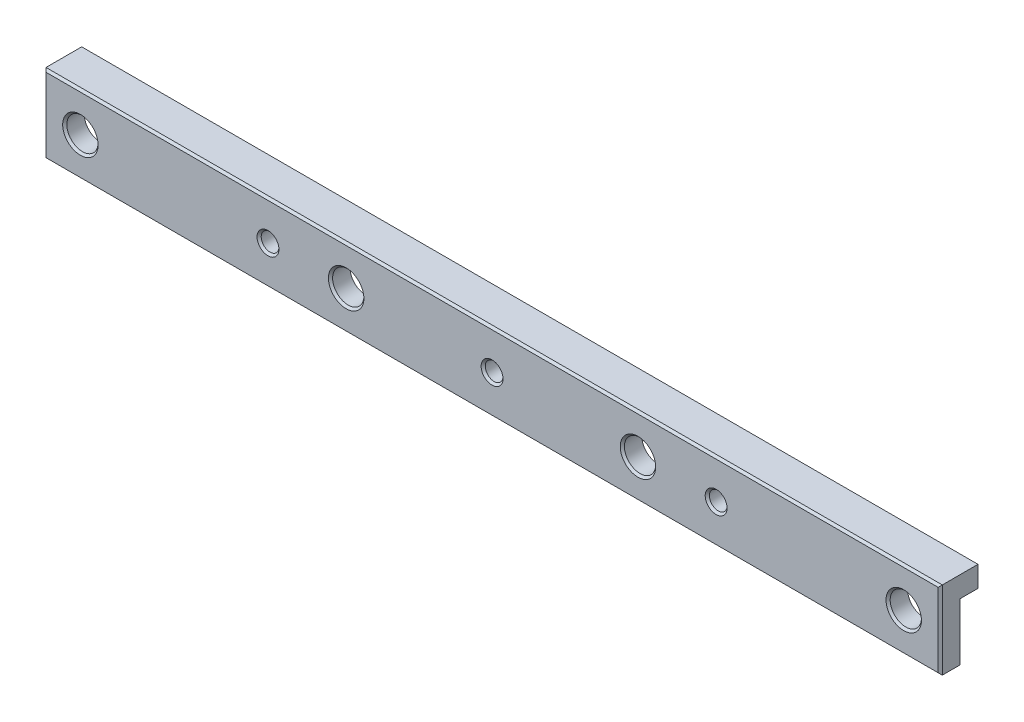
ISO-10303-21;
HEADER;
FILE_DESCRIPTION(('STEP AP214'),'2;1');
FILE_NAME('part.step','',(''),(''),'','','');
FILE_SCHEMA(('AUTOMOTIVE_DESIGN { 1 0 10303 214 1 1 1 1 }'));
ENDSEC;
DATA;
#1=APPLICATION_CONTEXT('core data for automotive mechanical design processes');
#2=APPLICATION_PROTOCOL_DEFINITION('international standard','automotive_design',2000,#1);
#3=PRODUCT_CONTEXT('',#1,'mechanical');
#4=PRODUCT('Part','Part','',(#3));
#5=PRODUCT_RELATED_PRODUCT_CATEGORY('part','',(#4));
#6=PRODUCT_DEFINITION_FORMATION('','',#4);
#7=PRODUCT_DEFINITION_CONTEXT('part definition',#1,'design');
#8=PRODUCT_DEFINITION('design','',#6,#7);
#9=PRODUCT_DEFINITION_SHAPE('','',#8);
#10=(LENGTH_UNIT() NAMED_UNIT(*) SI_UNIT(.MILLI.,.METRE.));
#11=(NAMED_UNIT(*) PLANE_ANGLE_UNIT() SI_UNIT($,.RADIAN.));
#12=(NAMED_UNIT(*) SI_UNIT($,.STERADIAN.) SOLID_ANGLE_UNIT());
#13=UNCERTAINTY_MEASURE_WITH_UNIT(LENGTH_MEASURE(1.E-05),#10,'distance_accuracy_value','');
#14=(GEOMETRIC_REPRESENTATION_CONTEXT(3) GLOBAL_UNCERTAINTY_ASSIGNED_CONTEXT((#13)) GLOBAL_UNIT_ASSIGNED_CONTEXT((#10,
#11,#12)) REPRESENTATION_CONTEXT('',''));
#15=CARTESIAN_POINT('',(0.,0.,0.));
#16=DIRECTION('',(0.,0.,1.));
#17=DIRECTION('',(1.,0.,0.));
#18=AXIS2_PLACEMENT_3D('',#15,#16,#17);
#19=CARTESIAN_POINT('',(86.,0.,-7.25));
#20=DIRECTION('',(-1.,0.,0.));
#21=DIRECTION('',(0.,0.,1.));
#22=AXIS2_PLACEMENT_3D('',#19,#20,#21);
#23=PLANE('',#22);
#24=DIRECTION('',(0.,0.,1.));
#25=VECTOR('',#24,1.);
#26=CARTESIAN_POINT('',(86.,7.50000000000001,-7.25));
#27=LINE('',#26,#25);
#28=CARTESIAN_POINT('',(86.,7.50000000000001,-7.25));
#29=VERTEX_POINT('',#28);
#30=CARTESIAN_POINT('',(86.,7.50000000000001,-0.400000000000013));
#31=VERTEX_POINT('',#30);
#32=EDGE_CURVE('E136',#29,#31,#27,.T.);
#33=ORIENTED_EDGE('',*,*,#32,.T.);
#34=DIRECTION('',(0.,-1.,0.));
#35=VECTOR('',#34,1.);
#36=CARTESIAN_POINT('',(86.,-7.49999999999999,-0.400000000000011));
#37=LINE('',#36,#35);
#38=CARTESIAN_POINT('',(86.,-7.49999999999999,-0.400000000000013));
#39=VERTEX_POINT('',#38);
#40=EDGE_CURVE('E196',#31,#39,#37,.T.);
#41=ORIENTED_EDGE('',*,*,#40,.T.);
#42=DIRECTION('',(0.,0.,1.));
#43=VECTOR('',#42,1.);
#44=CARTESIAN_POINT('',(86.,-7.49999999999999,-7.25));
#45=LINE('',#44,#43);
#46=CARTESIAN_POINT('',(86.,-7.49999999999999,-3.75));
#47=VERTEX_POINT('',#46);
#48=EDGE_CURVE('E132',#47,#39,#45,.T.);
#49=ORIENTED_EDGE('',*,*,#48,.F.);
#50=DIRECTION('',(0.,-1.,0.));
#51=VECTOR('',#50,1.);
#52=CARTESIAN_POINT('',(86.,0.,-3.75));
#53=LINE('',#52,#51);
#54=CARTESIAN_POINT('',(86.,3.50000000000001,-3.75));
#55=VERTEX_POINT('',#54);
#56=EDGE_CURVE('E115',#55,#47,#53,.T.);
#57=ORIENTED_EDGE('',*,*,#56,.F.);
#58=DIRECTION('',(0.,0.,-1.));
#59=VECTOR('',#58,1.);
#60=CARTESIAN_POINT('',(86.,3.50000000000001,-3.75));
#61=LINE('',#60,#59);
#62=CARTESIAN_POINT('',(86.,3.50000000000001,-7.25));
#63=VERTEX_POINT('',#62);
#64=EDGE_CURVE('E371',#55,#63,#61,.T.);
#65=ORIENTED_EDGE('',*,*,#64,.T.);
#66=DIRECTION('',(0.,-1.,0.));
#67=VECTOR('',#66,1.);
#68=CARTESIAN_POINT('',(86.,0.,-7.25));
#69=LINE('',#68,#67);
#70=EDGE_CURVE('E367',#29,#63,#69,.T.);
#71=ORIENTED_EDGE('',*,*,#70,.F.);
#72=EDGE_LOOP('',(#33,#41,#49,#57,#65,#71));
#73=FACE_BOUND('',#72,.T.);
#74=ADVANCED_FACE('F39',(#73),#23,.F.);
#75=CARTESIAN_POINT('',(-86.,0.,-7.25));
#76=DIRECTION('',(-1.,0.,0.));
#77=DIRECTION('',(0.,0.,1.));
#78=AXIS2_PLACEMENT_3D('',#75,#76,#77);
#79=PLANE('',#78);
#80=DIRECTION('',(0.,0.,1.));
#81=VECTOR('',#80,1.);
#82=CARTESIAN_POINT('',(-86.,-7.50000000000001,-7.25));
#83=LINE('',#82,#81);
#84=CARTESIAN_POINT('',(-86.,-7.50000000000001,-3.75));
#85=VERTEX_POINT('',#84);
#86=CARTESIAN_POINT('',(-86.,-7.50000000000001,-0.400000000000013));
#87=VERTEX_POINT('',#86);
#88=EDGE_CURVE('E123',#85,#87,#83,.T.);
#89=ORIENTED_EDGE('',*,*,#88,.T.);
#90=DIRECTION('',(0.,1.,0.));
#91=VECTOR('',#90,1.);
#92=CARTESIAN_POINT('',(-86.,0.,-0.400000000000011));
#93=LINE('',#92,#91);
#94=CARTESIAN_POINT('',(-86.,7.49999999999999,-0.400000000000013));
#95=VERTEX_POINT('',#94);
#96=EDGE_CURVE('E65',#87,#95,#93,.T.);
#97=ORIENTED_EDGE('',*,*,#96,.T.);
#98=DIRECTION('',(0.,0.,1.));
#99=VECTOR('',#98,1.);
#100=CARTESIAN_POINT('',(-86.,7.49999999999999,-7.25));
#101=LINE('',#100,#99);
#102=CARTESIAN_POINT('',(-86.,7.49999999999999,-7.25));
#103=VERTEX_POINT('',#102);
#104=EDGE_CURVE('E133',#103,#95,#101,.T.);
#105=ORIENTED_EDGE('',*,*,#104,.F.);
#106=DIRECTION('',(0.,-1.,0.));
#107=VECTOR('',#106,1.);
#108=CARTESIAN_POINT('',(-86.,0.,-7.25));
#109=LINE('',#108,#107);
#110=CARTESIAN_POINT('',(-86.,3.49999999999999,-7.25));
#111=VERTEX_POINT('',#110);
#112=EDGE_CURVE('E141',#103,#111,#109,.T.);
#113=ORIENTED_EDGE('',*,*,#112,.T.);
#114=DIRECTION('',(0.,0.,-1.));
#115=VECTOR('',#114,1.);
#116=CARTESIAN_POINT('',(-86.,3.49999999999999,-3.75));
#117=LINE('',#116,#115);
#118=CARTESIAN_POINT('',(-86.,3.49999999999999,-3.75));
#119=VERTEX_POINT('',#118);
#120=EDGE_CURVE('E125',#119,#111,#117,.T.);
#121=ORIENTED_EDGE('',*,*,#120,.F.);
#122=DIRECTION('',(0.,-1.,0.));
#123=VECTOR('',#122,1.);
#124=CARTESIAN_POINT('',(-86.,0.,-3.75));
#125=LINE('',#124,#123);
#126=EDGE_CURVE('E112',#119,#85,#125,.T.);
#127=ORIENTED_EDGE('',*,*,#126,.T.);
#128=EDGE_LOOP('',(#89,#97,#105,#113,#121,#127));
#129=FACE_BOUND('',#128,.T.);
#130=ADVANCED_FACE('F122',(#129),#79,.T.);
#131=CARTESIAN_POINT('',(0.,0.,-7.25));
#132=DIRECTION('',(0.,0.,1.));
#133=DIRECTION('',(1.,0.,0.));
#134=AXIS2_PLACEMENT_3D('',#131,#132,#133);
#135=PLANE('',#134);
#136=DIRECTION('',(-1.,0.,0.));
#137=VECTOR('',#136,1.);
#138=CARTESIAN_POINT('',(0.,3.5,-7.25));
#139=LINE('',#138,#137);
#140=EDGE_CURVE('E120',#63,#111,#139,.T.);
#141=ORIENTED_EDGE('',*,*,#140,.T.);
#142=ORIENTED_EDGE('',*,*,#112,.F.);
#143=DIRECTION('',(-1.,0.,0.));
#144=VECTOR('',#143,1.);
#145=CARTESIAN_POINT('',(0.,7.5,-7.25));
#146=LINE('',#145,#144);
#147=EDGE_CURVE('E363',#29,#103,#146,.T.);
#148=ORIENTED_EDGE('',*,*,#147,.F.);
#149=ORIENTED_EDGE('',*,*,#70,.T.);
#150=EDGE_LOOP('',(#141,#142,#148,#149));
#151=FACE_BOUND('',#150,.T.);
#152=ADVANCED_FACE('F257',(#151),#135,.F.);
#153=CARTESIAN_POINT('',(0.,-7.5,-7.25));
#154=DIRECTION('',(0.,1.,0.));
#155=DIRECTION('',(-1.,0.,0.));
#156=AXIS2_PLACEMENT_3D('',#153,#154,#155);
#157=PLANE('',#156);
#158=ORIENTED_EDGE('',*,*,#48,.T.);
#159=DIRECTION('',(-1.,0.,0.));
#160=VECTOR('',#159,1.);
#161=CARTESIAN_POINT('',(-86.,-7.50000000000001,-0.400000000000011));
#162=LINE('',#161,#160);
#163=EDGE_CURVE('E131',#39,#87,#162,.T.);
#164=ORIENTED_EDGE('',*,*,#163,.T.);
#165=ORIENTED_EDGE('',*,*,#88,.F.);
#166=DIRECTION('',(-1.,0.,0.));
#167=VECTOR('',#166,1.);
#168=CARTESIAN_POINT('',(0.,-7.5,-3.75));
#169=LINE('',#168,#167);
#170=EDGE_CURVE('E108',#47,#85,#169,.T.);
#171=ORIENTED_EDGE('',*,*,#170,.F.);
#172=EDGE_LOOP('',(#158,#164,#165,#171));
#173=FACE_BOUND('',#172,.T.);
#174=ADVANCED_FACE('F129',(#173),#157,.F.);
#175=CARTESIAN_POINT('',(0.,7.5,-7.25));
#176=DIRECTION('',(0.,1.,0.));
#177=DIRECTION('',(-1.,0.,0.));
#178=AXIS2_PLACEMENT_3D('',#175,#176,#177);
#179=PLANE('',#178);
#180=ORIENTED_EDGE('',*,*,#104,.T.);
#181=DIRECTION('',(1.,0.,0.));
#182=VECTOR('',#181,1.);
#183=CARTESIAN_POINT('',(0.,7.5,-0.400000000000011));
#184=LINE('',#183,#182);
#185=EDGE_CURVE('E57',#95,#31,#184,.T.);
#186=ORIENTED_EDGE('',*,*,#185,.T.);
#187=ORIENTED_EDGE('',*,*,#32,.F.);
#188=ORIENTED_EDGE('',*,*,#147,.T.);
#189=EDGE_LOOP('',(#180,#186,#187,#188));
#190=FACE_BOUND('',#189,.T.);
#191=ADVANCED_FACE('F260',(#190),#179,.T.);
#192=CARTESIAN_POINT('',(0.,0.,0.));
#193=DIRECTION('',(0.,0.,1.));
#194=DIRECTION('',(1.,0.,0.));
#195=AXIS2_PLACEMENT_3D('',#192,#193,#194);
#196=PLANE('',#195);
#197=DIRECTION('',(0.,-1.,0.));
#198=VECTOR('',#197,1.);
#199=CARTESIAN_POINT('',(-85.6,0.,0.));
#200=LINE('',#199,#198);
#201=CARTESIAN_POINT('',(-85.6,7.09999999999998,0.));
#202=VERTEX_POINT('',#201);
#203=CARTESIAN_POINT('',(-85.6,-7.1,0.));
#204=VERTEX_POINT('',#203);
#205=EDGE_CURVE('E189',#202,#204,#200,.T.);
#206=ORIENTED_EDGE('',*,*,#205,.T.);
#207=DIRECTION('',(1.,0.,0.));
#208=VECTOR('',#207,1.);
#209=CARTESIAN_POINT('',(86.,-7.09999999999998,0.));
#210=LINE('',#209,#208);
#211=CARTESIAN_POINT('',(85.6,-7.09999999999998,0.));
#212=VERTEX_POINT('',#211);
#213=EDGE_CURVE('E191',#204,#212,#210,.T.);
#214=ORIENTED_EDGE('',*,*,#213,.T.);
#215=DIRECTION('',(0.,1.,0.));
#216=VECTOR('',#215,1.);
#217=CARTESIAN_POINT('',(85.6,7.50000000000001,0.));
#218=LINE('',#217,#216);
#219=CARTESIAN_POINT('',(85.6,7.1,0.));
#220=VERTEX_POINT('',#219);
#221=EDGE_CURVE('E185',#212,#220,#218,.T.);
#222=ORIENTED_EDGE('',*,*,#221,.T.);
#223=DIRECTION('',(-1.,0.,0.));
#224=VECTOR('',#223,1.);
#225=CARTESIAN_POINT('',(0.,7.09999999999999,0.));
#226=LINE('',#225,#224);
#227=EDGE_CURVE('E187',#220,#202,#226,.T.);
#228=ORIENTED_EDGE('',*,*,#227,.T.);
#229=EDGE_LOOP('',(#206,#214,#222,#228));
#230=FACE_BOUND('',#229,.T.);
#231=CARTESIAN_POINT('',(0.,0.,0.));
#232=DIRECTION('',(0.,0.,1.));
#233=DIRECTION('',(1.,0.,0.));
#234=AXIS2_PLACEMENT_3D('',#231,#232,#233);
#235=CIRCLE('',#234,2.1000000000001);
#236=CARTESIAN_POINT('',(2.1000000000001,0.,0.));
#237=VERTEX_POINT('',#236);
#238=EDGE_CURVE('E182',#237,#237,#235,.F.);
#239=ORIENTED_EDGE('',*,*,#238,.T.);
#240=EDGE_LOOP('',(#239));
#241=FACE_BOUND('',#240,.T.);
#242=CARTESIAN_POINT('',(28.,0.,0.));
#243=DIRECTION('',(0.,0.,1.));
#244=DIRECTION('',(1.,0.,0.));
#245=AXIS2_PLACEMENT_3D('',#242,#243,#244);
#246=CIRCLE('',#245,3.4000000000001);
#247=CARTESIAN_POINT('',(31.4000000000001,0.,0.));
#248=VERTEX_POINT('',#247);
#249=EDGE_CURVE('E179',#248,#248,#246,.F.);
#250=ORIENTED_EDGE('',*,*,#249,.T.);
#251=EDGE_LOOP('',(#250));
#252=FACE_BOUND('',#251,.T.);
#253=CARTESIAN_POINT('',(-28.,0.,0.));
#254=DIRECTION('',(0.,0.,1.));
#255=DIRECTION('',(1.,0.,0.));
#256=AXIS2_PLACEMENT_3D('',#253,#254,#255);
#257=CIRCLE('',#256,3.40000000000007);
#258=CARTESIAN_POINT('',(-24.5999999999999,0.,0.));
#259=VERTEX_POINT('',#258);
#260=EDGE_CURVE('E176',#259,#259,#257,.F.);
#261=ORIENTED_EDGE('',*,*,#260,.T.);
#262=EDGE_LOOP('',(#261));
#263=FACE_BOUND('',#262,.T.);
#264=CARTESIAN_POINT('',(-43.,0.,0.));
#265=DIRECTION('',(0.,0.,1.));
#266=DIRECTION('',(1.,0.,0.));
#267=AXIS2_PLACEMENT_3D('',#264,#265,#266);
#268=CIRCLE('',#267,2.1000000000001);
#269=CARTESIAN_POINT('',(-40.8999999999999,0.,0.));
#270=VERTEX_POINT('',#269);
#271=EDGE_CURVE('E173',#270,#270,#268,.F.);
#272=ORIENTED_EDGE('',*,*,#271,.T.);
#273=EDGE_LOOP('',(#272));
#274=FACE_BOUND('',#273,.T.);
#275=CARTESIAN_POINT('',(43.,0.,0.));
#276=DIRECTION('',(0.,0.,1.));
#277=DIRECTION('',(1.,0.,0.));
#278=AXIS2_PLACEMENT_3D('',#275,#276,#277);
#279=CIRCLE('',#278,2.1000000000001);
#280=CARTESIAN_POINT('',(45.1000000000001,0.,0.));
#281=VERTEX_POINT('',#280);
#282=EDGE_CURVE('E170',#281,#281,#279,.F.);
#283=ORIENTED_EDGE('',*,*,#282,.T.);
#284=EDGE_LOOP('',(#283));
#285=FACE_BOUND('',#284,.T.);
#286=CARTESIAN_POINT('',(-79.,0.,0.));
#287=DIRECTION('',(0.,0.,1.));
#288=DIRECTION('',(1.,0.,0.));
#289=AXIS2_PLACEMENT_3D('',#286,#287,#288);
#290=CIRCLE('',#289,3.40000000000007);
#291=CARTESIAN_POINT('',(-75.5999999999999,0.,0.));
#292=VERTEX_POINT('',#291);
#293=EDGE_CURVE('E167',#292,#292,#290,.F.);
#294=ORIENTED_EDGE('',*,*,#293,.T.);
#295=EDGE_LOOP('',(#294));
#296=FACE_BOUND('',#295,.T.);
#297=CARTESIAN_POINT('',(79.,0.,0.));
#298=DIRECTION('',(0.,0.,1.));
#299=DIRECTION('',(1.,0.,0.));
#300=AXIS2_PLACEMENT_3D('',#297,#298,#299);
#301=CIRCLE('',#300,3.4000000000001);
#302=CARTESIAN_POINT('',(82.4000000000001,0.,0.));
#303=VERTEX_POINT('',#302);
#304=EDGE_CURVE('E164',#303,#303,#301,.F.);
#305=ORIENTED_EDGE('',*,*,#304,.T.);
#306=EDGE_LOOP('',(#305));
#307=FACE_BOUND('',#306,.T.);
#308=ADVANCED_FACE('F234',(#230,#241,#252,#263,#274,#285,#296,#307),#196,.T.);
#309=CARTESIAN_POINT('',(0.,3.5,-3.75));
#310=DIRECTION('',(0.,-1.,0.));
#311=DIRECTION('',(1.,0.,0.));
#312=AXIS2_PLACEMENT_3D('',#309,#310,#311);
#313=PLANE('',#312);
#314=ORIENTED_EDGE('',*,*,#140,.F.);
#315=ORIENTED_EDGE('',*,*,#64,.F.);
#316=DIRECTION('',(-1.,0.,0.));
#317=VECTOR('',#316,1.);
#318=CARTESIAN_POINT('',(0.,3.5,-3.75));
#319=LINE('',#318,#317);
#320=EDGE_CURVE('E126',#55,#119,#319,.T.);
#321=ORIENTED_EDGE('',*,*,#320,.T.);
#322=ORIENTED_EDGE('',*,*,#120,.T.);
#323=EDGE_LOOP('',(#314,#315,#321,#322));
#324=FACE_BOUND('',#323,.T.);
#325=ADVANCED_FACE('F321',(#324),#313,.T.);
#326=CARTESIAN_POINT('',(0.,0.,-3.75));
#327=DIRECTION('',(0.,0.,1.));
#328=DIRECTION('',(1.,0.,0.));
#329=AXIS2_PLACEMENT_3D('',#326,#327,#328);
#330=PLANE('',#329);
#331=CARTESIAN_POINT('',(79.,0.,-3.75));
#332=DIRECTION('',(0.,0.,1.));
#333=DIRECTION('',(1.,0.,0.));
#334=AXIS2_PLACEMENT_3D('',#331,#332,#333);
#335=CIRCLE('',#334,3.00000000000001);
#336=CARTESIAN_POINT('',(82.,0.,-3.75));
#337=VERTEX_POINT('',#336);
#338=EDGE_CURVE('E160',#337,#337,#335,.T.);
#339=ORIENTED_EDGE('',*,*,#338,.T.);
#340=EDGE_LOOP('',(#339));
#341=FACE_BOUND('',#340,.T.);
#342=CARTESIAN_POINT('',(-79.,0.,-3.75));
#343=DIRECTION('',(0.,0.,1.));
#344=DIRECTION('',(1.,0.,0.));
#345=AXIS2_PLACEMENT_3D('',#342,#343,#344);
#346=CIRCLE('',#345,3.00000000000001);
#347=CARTESIAN_POINT('',(-76.,0.,-3.75));
#348=VERTEX_POINT('',#347);
#349=EDGE_CURVE('E157',#348,#348,#346,.T.);
#350=ORIENTED_EDGE('',*,*,#349,.T.);
#351=EDGE_LOOP('',(#350));
#352=FACE_BOUND('',#351,.T.);
#353=CARTESIAN_POINT('',(43.,0.,-3.75));
#354=DIRECTION('',(0.,0.,1.));
#355=DIRECTION('',(1.,0.,0.));
#356=AXIS2_PLACEMENT_3D('',#353,#354,#355);
#357=CIRCLE('',#356,1.7);
#358=CARTESIAN_POINT('',(44.7,0.,-3.75));
#359=VERTEX_POINT('',#358);
#360=EDGE_CURVE('E154',#359,#359,#357,.T.);
#361=ORIENTED_EDGE('',*,*,#360,.T.);
#362=EDGE_LOOP('',(#361));
#363=FACE_BOUND('',#362,.T.);
#364=CARTESIAN_POINT('',(-43.,0.,-3.75));
#365=DIRECTION('',(0.,0.,1.));
#366=DIRECTION('',(1.,0.,0.));
#367=AXIS2_PLACEMENT_3D('',#364,#365,#366);
#368=CIRCLE('',#367,1.7);
#369=CARTESIAN_POINT('',(-41.3,0.,-3.75));
#370=VERTEX_POINT('',#369);
#371=EDGE_CURVE('E151',#370,#370,#368,.T.);
#372=ORIENTED_EDGE('',*,*,#371,.T.);
#373=EDGE_LOOP('',(#372));
#374=FACE_BOUND('',#373,.T.);
#375=CARTESIAN_POINT('',(-28.,0.,-3.75));
#376=DIRECTION('',(0.,0.,1.));
#377=DIRECTION('',(1.,0.,0.));
#378=AXIS2_PLACEMENT_3D('',#375,#376,#377);
#379=CIRCLE('',#378,3.);
#380=CARTESIAN_POINT('',(-25.,0.,-3.75));
#381=VERTEX_POINT('',#380);
#382=EDGE_CURVE('E148',#381,#381,#379,.T.);
#383=ORIENTED_EDGE('',*,*,#382,.T.);
#384=EDGE_LOOP('',(#383));
#385=FACE_BOUND('',#384,.T.);
#386=CARTESIAN_POINT('',(28.,0.,-3.75));
#387=DIRECTION('',(0.,0.,1.));
#388=DIRECTION('',(1.,0.,0.));
#389=AXIS2_PLACEMENT_3D('',#386,#387,#388);
#390=CIRCLE('',#389,3.);
#391=CARTESIAN_POINT('',(31.,0.,-3.75));
#392=VERTEX_POINT('',#391);
#393=EDGE_CURVE('E145',#392,#392,#390,.T.);
#394=ORIENTED_EDGE('',*,*,#393,.T.);
#395=EDGE_LOOP('',(#394));
#396=FACE_BOUND('',#395,.T.);
#397=CARTESIAN_POINT('',(0.,0.,-3.75));
#398=DIRECTION('',(0.,0.,1.));
#399=DIRECTION('',(1.,0.,0.));
#400=AXIS2_PLACEMENT_3D('',#397,#398,#399);
#401=CIRCLE('',#400,1.7);
#402=CARTESIAN_POINT('',(1.7,0.,-3.75));
#403=VERTEX_POINT('',#402);
#404=EDGE_CURVE('E142',#403,#403,#401,.T.);
#405=ORIENTED_EDGE('',*,*,#404,.T.);
#406=EDGE_LOOP('',(#405));
#407=FACE_BOUND('',#406,.T.);
#408=ORIENTED_EDGE('',*,*,#170,.T.);
#409=ORIENTED_EDGE('',*,*,#126,.F.);
#410=ORIENTED_EDGE('',*,*,#320,.F.);
#411=ORIENTED_EDGE('',*,*,#56,.T.);
#412=EDGE_LOOP('',(#408,#409,#410,#411));
#413=FACE_BOUND('',#412,.T.);
#414=ADVANCED_FACE('F110',(#341,#352,#363,#374,#385,#396,#407,#413),#330,.F.);
#415=CARTESIAN_POINT('',(0.,0.,-7.25));
#416=DIRECTION('',(0.,0.,1.));
#417=DIRECTION('',(1.,0.,0.));
#418=AXIS2_PLACEMENT_3D('',#415,#416,#417);
#419=CYLINDRICAL_SURFACE('',#418,1.7);
#420=CARTESIAN_POINT('',(0.,0.,-0.400000000000108));
#421=DIRECTION('',(0.,0.,1.));
#422=DIRECTION('',(1.,0.,0.));
#423=AXIS2_PLACEMENT_3D('',#420,#421,#422);
#424=CIRCLE('',#423,1.7);
#425=CARTESIAN_POINT('',(1.7,0.,-0.400000000000108));
#426=VERTEX_POINT('',#425);
#427=EDGE_CURVE('E198',#426,#426,#424,.T.);
#428=ORIENTED_EDGE('',*,*,#427,.T.);
#429=EDGE_LOOP('',(#428));
#430=FACE_BOUND('',#429,.T.);
#431=ORIENTED_EDGE('',*,*,#404,.F.);
#432=EDGE_LOOP('',(#431));
#433=FACE_BOUND('',#432,.T.);
#434=ADVANCED_FACE('F320',(#430,#433),#419,.F.);
#435=CARTESIAN_POINT('',(28.,0.,-7.25));
#436=DIRECTION('',(0.,0.,1.));
#437=DIRECTION('',(1.,0.,0.));
#438=AXIS2_PLACEMENT_3D('',#435,#436,#437);
#439=CYLINDRICAL_SURFACE('',#438,3.);
#440=CARTESIAN_POINT('',(28.,0.,-0.400000000000096));
#441=DIRECTION('',(0.,0.,1.));
#442=DIRECTION('',(1.,0.,0.));
#443=AXIS2_PLACEMENT_3D('',#440,#441,#442);
#444=CIRCLE('',#443,3.);
#445=CARTESIAN_POINT('',(31.,0.,-0.400000000000096));
#446=VERTEX_POINT('',#445);
#447=EDGE_CURVE('E201',#446,#446,#444,.T.);
#448=ORIENTED_EDGE('',*,*,#447,.T.);
#449=EDGE_LOOP('',(#448));
#450=FACE_BOUND('',#449,.T.);
#451=ORIENTED_EDGE('',*,*,#393,.F.);
#452=EDGE_LOOP('',(#451));
#453=FACE_BOUND('',#452,.T.);
#454=ADVANCED_FACE('F335',(#450,#453),#439,.F.);
#455=CARTESIAN_POINT('',(-28.,0.,-7.25));
#456=DIRECTION('',(0.,0.,1.));
#457=DIRECTION('',(1.,0.,0.));
#458=AXIS2_PLACEMENT_3D('',#455,#456,#457);
#459=CYLINDRICAL_SURFACE('',#458,3.);
#460=CARTESIAN_POINT('',(-28.,0.,-0.400000000000068));
#461=DIRECTION('',(0.,0.,1.));
#462=DIRECTION('',(1.,0.,0.));
#463=AXIS2_PLACEMENT_3D('',#460,#461,#462);
#464=CIRCLE('',#463,3.);
#465=CARTESIAN_POINT('',(-25.,0.,-0.400000000000068));
#466=VERTEX_POINT('',#465);
#467=EDGE_CURVE('E204',#466,#466,#464,.T.);
#468=ORIENTED_EDGE('',*,*,#467,.T.);
#469=EDGE_LOOP('',(#468));
#470=FACE_BOUND('',#469,.T.);
#471=ORIENTED_EDGE('',*,*,#382,.F.);
#472=EDGE_LOOP('',(#471));
#473=FACE_BOUND('',#472,.T.);
#474=ADVANCED_FACE('F341',(#470,#473),#459,.F.);
#475=CARTESIAN_POINT('',(-43.,0.,-7.25));
#476=DIRECTION('',(0.,0.,1.));
#477=DIRECTION('',(1.,0.,0.));
#478=AXIS2_PLACEMENT_3D('',#475,#476,#477);
#479=CYLINDRICAL_SURFACE('',#478,1.7);
#480=CARTESIAN_POINT('',(-43.,0.,-0.400000000000094));
#481=DIRECTION('',(0.,0.,1.));
#482=DIRECTION('',(1.,0.,0.));
#483=AXIS2_PLACEMENT_3D('',#480,#481,#482);
#484=CIRCLE('',#483,1.7);
#485=CARTESIAN_POINT('',(-41.3,0.,-0.400000000000094));
#486=VERTEX_POINT('',#485);
#487=EDGE_CURVE('E207',#486,#486,#484,.T.);
#488=ORIENTED_EDGE('',*,*,#487,.T.);
#489=EDGE_LOOP('',(#488));
#490=FACE_BOUND('',#489,.T.);
#491=ORIENTED_EDGE('',*,*,#371,.F.);
#492=EDGE_LOOP('',(#491));
#493=FACE_BOUND('',#492,.T.);
#494=ADVANCED_FACE('F459',(#490,#493),#479,.F.);
#495=CARTESIAN_POINT('',(43.,0.,-7.25));
#496=DIRECTION('',(0.,0.,1.));
#497=DIRECTION('',(1.,0.,0.));
#498=AXIS2_PLACEMENT_3D('',#495,#496,#497);
#499=CYLINDRICAL_SURFACE('',#498,1.7);
#500=CARTESIAN_POINT('',(43.,0.,-0.400000000000094));
#501=DIRECTION('',(0.,0.,1.));
#502=DIRECTION('',(1.,0.,0.));
#503=AXIS2_PLACEMENT_3D('',#500,#501,#502);
#504=CIRCLE('',#503,1.7);
#505=CARTESIAN_POINT('',(44.7,0.,-0.400000000000094));
#506=VERTEX_POINT('',#505);
#507=EDGE_CURVE('E210',#506,#506,#504,.T.);
#508=ORIENTED_EDGE('',*,*,#507,.T.);
#509=EDGE_LOOP('',(#508));
#510=FACE_BOUND('',#509,.T.);
#511=ORIENTED_EDGE('',*,*,#360,.F.);
#512=EDGE_LOOP('',(#511));
#513=FACE_BOUND('',#512,.T.);
#514=ADVANCED_FACE('F314',(#510,#513),#499,.F.);
#515=CARTESIAN_POINT('',(-79.,0.,-7.25));
#516=DIRECTION('',(0.,0.,1.));
#517=DIRECTION('',(1.,0.,0.));
#518=AXIS2_PLACEMENT_3D('',#515,#516,#517);
#519=CYLINDRICAL_SURFACE('',#518,3.00000000000001);
#520=CARTESIAN_POINT('',(-79.,0.,-0.400000000000057));
#521=DIRECTION('',(0.,0.,1.));
#522=DIRECTION('',(1.,0.,0.));
#523=AXIS2_PLACEMENT_3D('',#520,#521,#522);
#524=CIRCLE('',#523,3.00000000000001);
#525=CARTESIAN_POINT('',(-76.,0.,-0.400000000000057));
#526=VERTEX_POINT('',#525);
#527=EDGE_CURVE('E49',#526,#526,#524,.T.);
#528=ORIENTED_EDGE('',*,*,#527,.T.);
#529=EDGE_LOOP('',(#528));
#530=FACE_BOUND('',#529,.T.);
#531=ORIENTED_EDGE('',*,*,#349,.F.);
#532=EDGE_LOOP('',(#531));
#533=FACE_BOUND('',#532,.T.);
#534=ADVANCED_FACE('F310',(#530,#533),#519,.F.);
#535=CARTESIAN_POINT('',(79.,0.,-7.25));
#536=DIRECTION('',(0.,0.,1.));
#537=DIRECTION('',(1.,0.,0.));
#538=AXIS2_PLACEMENT_3D('',#535,#536,#537);
#539=CYLINDRICAL_SURFACE('',#538,3.00000000000001);
#540=CARTESIAN_POINT('',(79.,0.,-0.400000000000085));
#541=DIRECTION('',(0.,0.,1.));
#542=DIRECTION('',(1.,0.,0.));
#543=AXIS2_PLACEMENT_3D('',#540,#541,#542);
#544=CIRCLE('',#543,3.00000000000001);
#545=CARTESIAN_POINT('',(82.,0.,-0.400000000000085));
#546=VERTEX_POINT('',#545);
#547=EDGE_CURVE('E11',#546,#546,#544,.T.);
#548=ORIENTED_EDGE('',*,*,#547,.T.);
#549=EDGE_LOOP('',(#548));
#550=FACE_BOUND('',#549,.T.);
#551=ORIENTED_EDGE('',*,*,#338,.F.);
#552=EDGE_LOOP('',(#551));
#553=FACE_BOUND('',#552,.T.);
#554=ADVANCED_FACE('F313',(#550,#553),#539,.F.);
#555=CARTESIAN_POINT('',(0.,7.09999999999999,0.));
#556=DIRECTION('',(0.,-0.707106781186548,-0.707106781186548));
#557=DIRECTION('',(-1.,0.,0.));
#558=AXIS2_PLACEMENT_3D('',#555,#556,#557);
#559=PLANE('',#558);
#560=DIRECTION('',(0.577350269189626,-0.577350269189626,0.577350269189626));
#561=VECTOR('',#560,1.);
#562=CARTESIAN_POINT('',(-57.0666666666667,-21.4333333333333,28.5333333333333));
#563=LINE('',#562,#561);
#564=EDGE_CURVE('E218',#202,#95,#563,.F.);
#565=ORIENTED_EDGE('',*,*,#564,.F.);
#566=ORIENTED_EDGE('',*,*,#227,.F.);
#567=DIRECTION('',(0.577350269189626,0.577350269189626,-0.577350269189626));
#568=VECTOR('',#567,1.);
#569=CARTESIAN_POINT('',(83.5,5.00000000000001,2.09999999999999));
#570=LINE('',#569,#568);
#571=EDGE_CURVE('E44',#31,#220,#570,.F.);
#572=ORIENTED_EDGE('',*,*,#571,.F.);
#573=ORIENTED_EDGE('',*,*,#185,.F.);
#574=EDGE_LOOP('',(#565,#566,#572,#573));
#575=FACE_BOUND('',#574,.T.);
#576=ADVANCED_FACE('F232',(#575),#559,.F.);
#577=CARTESIAN_POINT('',(86.,0.,-0.400000000000011));
#578=DIRECTION('',(0.707106781186548,0.,0.707106781186548));
#579=DIRECTION('',(0.,1.,0.));
#580=AXIS2_PLACEMENT_3D('',#577,#578,#579);
#581=PLANE('',#580);
#582=ORIENTED_EDGE('',*,*,#571,.T.);
#583=ORIENTED_EDGE('',*,*,#221,.F.);
#584=DIRECTION('',(0.577350269189626,-0.577350269189626,-0.577350269189626));
#585=VECTOR('',#584,1.);
#586=CARTESIAN_POINT('',(83.5,-4.99999999999999,2.09999999999998));
#587=LINE('',#586,#585);
#588=EDGE_CURVE('E217',#39,#212,#587,.F.);
#589=ORIENTED_EDGE('',*,*,#588,.F.);
#590=ORIENTED_EDGE('',*,*,#40,.F.);
#591=EDGE_LOOP('',(#582,#583,#589,#590));
#592=FACE_BOUND('',#591,.T.);
#593=ADVANCED_FACE('F228',(#592),#581,.T.);
#594=CARTESIAN_POINT('',(-85.6,0.,0.));
#595=DIRECTION('',(0.707106781186548,0.,-0.707106781186548));
#596=DIRECTION('',(0.,-1.,0.));
#597=AXIS2_PLACEMENT_3D('',#594,#595,#596);
#598=PLANE('',#597);
#599=ORIENTED_EDGE('',*,*,#564,.T.);
#600=ORIENTED_EDGE('',*,*,#96,.F.);
#601=DIRECTION('',(-0.577350269189626,-0.577350269189626,-0.577350269189626));
#602=VECTOR('',#601,1.);
#603=CARTESIAN_POINT('',(-83.2333333333333,-4.73333333333333,2.36666666666667));
#604=LINE('',#603,#602);
#605=EDGE_CURVE('E215',#204,#87,#604,.T.);
#606=ORIENTED_EDGE('',*,*,#605,.F.);
#607=ORIENTED_EDGE('',*,*,#205,.F.);
#608=EDGE_LOOP('',(#599,#600,#606,#607));
#609=FACE_BOUND('',#608,.T.);
#610=ADVANCED_FACE('F240',(#609),#598,.F.);
#611=CARTESIAN_POINT('',(0.,-7.5,-0.400000000000011));
#612=DIRECTION('',(0.,-0.707106781186548,0.707106781186548));
#613=DIRECTION('',(1.,0.,0.));
#614=AXIS2_PLACEMENT_3D('',#611,#612,#613);
#615=PLANE('',#614);
#616=ORIENTED_EDGE('',*,*,#588,.T.);
#617=ORIENTED_EDGE('',*,*,#213,.F.);
#618=ORIENTED_EDGE('',*,*,#605,.T.);
#619=ORIENTED_EDGE('',*,*,#163,.F.);
#620=EDGE_LOOP('',(#616,#617,#618,#619));
#621=FACE_BOUND('',#620,.T.);
#622=ADVANCED_FACE('F239',(#621),#615,.T.);
#623=CARTESIAN_POINT('',(0.,0.,-0.400000000000108));
#624=DIRECTION('',(0.,0.,1.));
#625=DIRECTION('',(1.,0.,0.));
#626=AXIS2_PLACEMENT_3D('',#623,#624,#625);
#627=CONICAL_SURFACE('',#626,1.7,0.785398163397441);
#628=ORIENTED_EDGE('',*,*,#238,.F.);
#629=EDGE_LOOP('',(#628));
#630=FACE_BOUND('',#629,.T.);
#631=ORIENTED_EDGE('',*,*,#427,.F.);
#632=EDGE_LOOP('',(#631));
#633=FACE_BOUND('',#632,.T.);
#634=ADVANCED_FACE('F247',(#630,#633),#627,.F.);
#635=CARTESIAN_POINT('',(28.,0.,-0.400000000000096));
#636=DIRECTION('',(0.,0.,1.));
#637=DIRECTION('',(1.,0.,0.));
#638=AXIS2_PLACEMENT_3D('',#635,#636,#637);
#639=CONICAL_SURFACE('',#638,3.,0.785398163397454);
#640=ORIENTED_EDGE('',*,*,#249,.F.);
#641=EDGE_LOOP('',(#640));
#642=FACE_BOUND('',#641,.T.);
#643=ORIENTED_EDGE('',*,*,#447,.F.);
#644=EDGE_LOOP('',(#643));
#645=FACE_BOUND('',#644,.T.);
#646=ADVANCED_FACE('F277',(#642,#645),#639,.F.);
#647=CARTESIAN_POINT('',(-28.,0.,-0.400000000000068));
#648=DIRECTION('',(0.,0.,1.));
#649=DIRECTION('',(1.,0.,0.));
#650=AXIS2_PLACEMENT_3D('',#647,#648,#649);
#651=CONICAL_SURFACE('',#650,3.,0.785398163397449);
#652=ORIENTED_EDGE('',*,*,#260,.F.);
#653=EDGE_LOOP('',(#652));
#654=FACE_BOUND('',#653,.T.);
#655=ORIENTED_EDGE('',*,*,#467,.F.);
#656=EDGE_LOOP('',(#655));
#657=FACE_BOUND('',#656,.T.);
#658=ADVANCED_FACE('F282',(#654,#657),#651,.F.);
#659=CARTESIAN_POINT('',(-43.,0.,-0.400000000000094));
#660=DIRECTION('',(0.,0.,1.));
#661=DIRECTION('',(1.,0.,0.));
#662=AXIS2_PLACEMENT_3D('',#659,#660,#661);
#663=CONICAL_SURFACE('',#662,1.7,0.785398163397459);
#664=ORIENTED_EDGE('',*,*,#271,.F.);
#665=EDGE_LOOP('',(#664));
#666=FACE_BOUND('',#665,.T.);
#667=ORIENTED_EDGE('',*,*,#487,.F.);
#668=EDGE_LOOP('',(#667));
#669=FACE_BOUND('',#668,.T.);
#670=ADVANCED_FACE('F287',(#666,#669),#663,.F.);
#671=CARTESIAN_POINT('',(43.,0.,-0.400000000000094));
#672=DIRECTION('',(0.,0.,1.));
#673=DIRECTION('',(1.,0.,0.));
#674=AXIS2_PLACEMENT_3D('',#671,#672,#673);
#675=CONICAL_SURFACE('',#674,1.7,0.785398163397459);
#676=ORIENTED_EDGE('',*,*,#282,.F.);
#677=EDGE_LOOP('',(#676));
#678=FACE_BOUND('',#677,.T.);
#679=ORIENTED_EDGE('',*,*,#507,.F.);
#680=EDGE_LOOP('',(#679));
#681=FACE_BOUND('',#680,.T.);
#682=ADVANCED_FACE('F292',(#678,#681),#675,.F.);
#683=CARTESIAN_POINT('',(-79.,0.,-0.400000000000057));
#684=DIRECTION('',(0.,0.,1.));
#685=DIRECTION('',(1.,0.,0.));
#686=AXIS2_PLACEMENT_3D('',#683,#684,#685);
#687=CONICAL_SURFACE('',#686,3.00000000000001,0.785398163397454);
#688=ORIENTED_EDGE('',*,*,#293,.F.);
#689=EDGE_LOOP('',(#688));
#690=FACE_BOUND('',#689,.T.);
#691=ORIENTED_EDGE('',*,*,#527,.F.);
#692=EDGE_LOOP('',(#691));
#693=FACE_BOUND('',#692,.T.);
#694=ADVANCED_FACE('F295',(#690,#693),#687,.F.);
#695=CARTESIAN_POINT('',(79.,0.,-0.400000000000085));
#696=DIRECTION('',(0.,0.,1.));
#697=DIRECTION('',(1.,0.,0.));
#698=AXIS2_PLACEMENT_3D('',#695,#696,#697);
#699=CONICAL_SURFACE('',#698,3.00000000000001,0.785398163397454);
#700=ORIENTED_EDGE('',*,*,#304,.F.);
#701=EDGE_LOOP('',(#700));
#702=FACE_BOUND('',#701,.T.);
#703=ORIENTED_EDGE('',*,*,#547,.F.);
#704=EDGE_LOOP('',(#703));
#705=FACE_BOUND('',#704,.T.);
#706=ADVANCED_FACE('F42',(#702,#705),#699,.F.);
#707=CLOSED_SHELL('',(#74,#130,#152,#174,#191,#308,#325,#414,#434,#454,#474,#494,#514,#534,#554,
#576,#593,#610,#622,#634,#646,#658,#670,#682,#694,#706));
#708=MANIFOLD_SOLID_BREP('B2',#707);
#709=ADVANCED_BREP_SHAPE_REPRESENTATION('',(#18,#708),#14);
#710=SHAPE_DEFINITION_REPRESENTATION(#9,#709);
ENDSEC;
END-ISO-10303-21;
